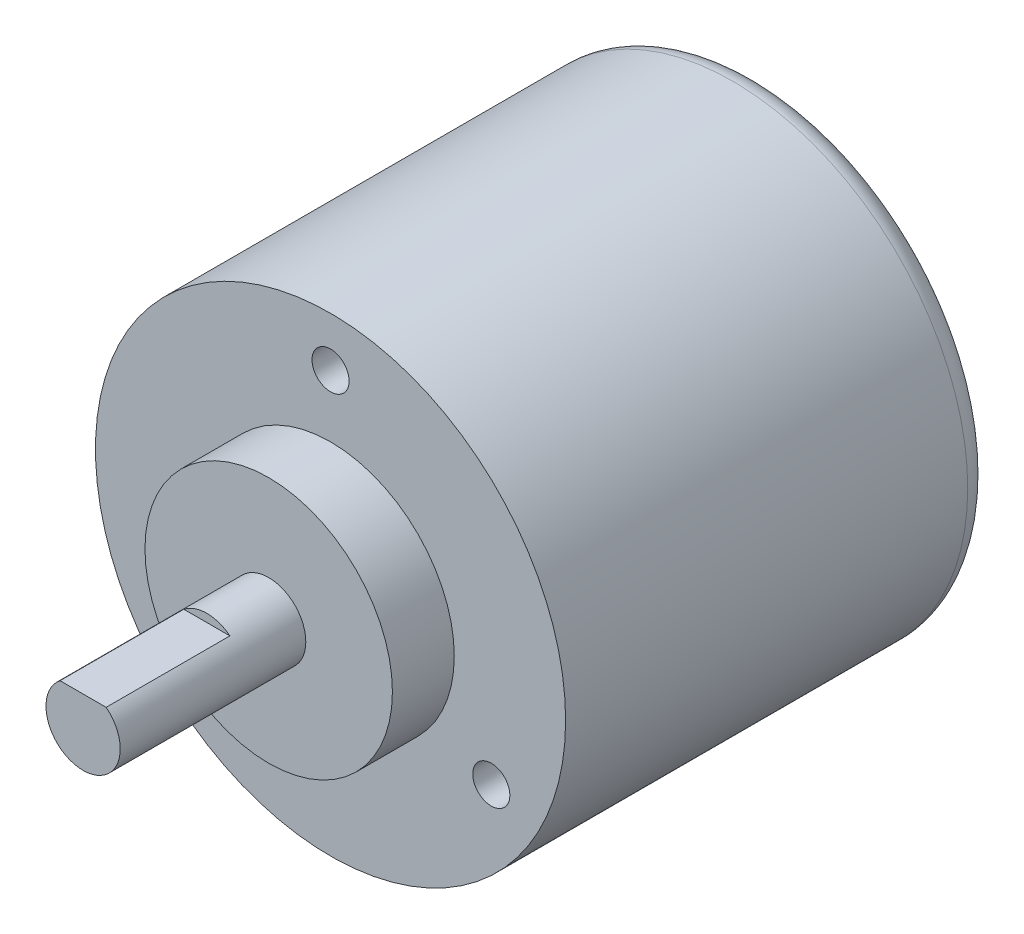
ISO-10303-21;
HEADER;
FILE_DESCRIPTION(('STEP AP214'),'2;1');
FILE_NAME('part.step','',(''),(''),'','','');
FILE_SCHEMA(('AUTOMOTIVE_DESIGN { 1 0 10303 214 1 1 1 1 }'));
ENDSEC;
DATA;
#1=APPLICATION_CONTEXT('core data for automotive mechanical design processes');
#2=APPLICATION_PROTOCOL_DEFINITION('international standard','automotive_design',2000,#1);
#3=PRODUCT_CONTEXT('',#1,'mechanical');
#4=PRODUCT('Part','Part','',(#3));
#5=PRODUCT_RELATED_PRODUCT_CATEGORY('part','',(#4));
#6=PRODUCT_DEFINITION_FORMATION('','',#4);
#7=PRODUCT_DEFINITION_CONTEXT('part definition',#1,'design');
#8=PRODUCT_DEFINITION('design','',#6,#7);
#9=PRODUCT_DEFINITION_SHAPE('','',#8);
#10=(LENGTH_UNIT() NAMED_UNIT(*) SI_UNIT(.MILLI.,.METRE.));
#11=(NAMED_UNIT(*) PLANE_ANGLE_UNIT() SI_UNIT($,.RADIAN.));
#12=(NAMED_UNIT(*) SI_UNIT($,.STERADIAN.) SOLID_ANGLE_UNIT());
#13=UNCERTAINTY_MEASURE_WITH_UNIT(LENGTH_MEASURE(1.E-05),#10,'distance_accuracy_value','');
#14=(GEOMETRIC_REPRESENTATION_CONTEXT(3) GLOBAL_UNCERTAINTY_ASSIGNED_CONTEXT((#13)) GLOBAL_UNIT_ASSIGNED_CONTEXT((#10,
#11,#12)) REPRESENTATION_CONTEXT('',''));
#15=CARTESIAN_POINT('',(0.,0.,0.));
#16=DIRECTION('',(0.,0.,1.));
#17=DIRECTION('',(1.,0.,0.));
#18=AXIS2_PLACEMENT_3D('',#15,#16,#17);
#19=CARTESIAN_POINT('',(0.,0.,34.5));
#20=DIRECTION('',(0.,0.,-1.));
#21=DIRECTION('',(-1.,0.,0.));
#22=AXIS2_PLACEMENT_3D('',#19,#20,#21);
#23=CYLINDRICAL_SURFACE('',#22,19.);
#24=CARTESIAN_POINT('',(0.,0.,2.));
#25=DIRECTION('',(0.,0.,1.));
#26=DIRECTION('',(1.,0.,0.));
#27=AXIS2_PLACEMENT_3D('',#24,#25,#26);
#28=CIRCLE('',#27,19.);
#29=CARTESIAN_POINT('',(19.,0.,2.));
#30=VERTEX_POINT('',#29);
#31=EDGE_CURVE('E43',#30,#30,#28,.T.);
#32=ORIENTED_EDGE('',*,*,#31,.T.);
#33=EDGE_LOOP('',(#32));
#34=FACE_BOUND('',#33,.T.);
#35=CARTESIAN_POINT('',(0.,0.,34.5));
#36=DIRECTION('',(0.,0.,1.));
#37=DIRECTION('',(1.,0.,0.));
#38=AXIS2_PLACEMENT_3D('',#35,#36,#37);
#39=CIRCLE('',#38,19.);
#40=CARTESIAN_POINT('',(19.,0.,34.5));
#41=VERTEX_POINT('',#40);
#42=EDGE_CURVE('E88',#41,#41,#39,.T.);
#43=ORIENTED_EDGE('',*,*,#42,.F.);
#44=EDGE_LOOP('',(#43));
#45=FACE_BOUND('',#44,.T.);
#46=ADVANCED_FACE('F35',(#34,#45),#23,.T.);
#47=CARTESIAN_POINT('',(0.,0.,34.5));
#48=DIRECTION('',(0.,0.,1.));
#49=DIRECTION('',(1.,0.,0.));
#50=AXIS2_PLACEMENT_3D('',#47,#48,#49);
#51=PLANE('',#50);
#52=CARTESIAN_POINT('',(0.,15.,34.5));
#53=DIRECTION('',(0.,0.,1.));
#54=DIRECTION('',(1.,0.,0.));
#55=AXIS2_PLACEMENT_3D('',#52,#53,#54);
#56=CIRCLE('',#55,1.5);
#57=CARTESIAN_POINT('',(1.5,15.,34.5));
#58=VERTEX_POINT('',#57);
#59=EDGE_CURVE('E160',#58,#58,#56,.T.);
#60=ORIENTED_EDGE('',*,*,#59,.F.);
#61=EDGE_LOOP('',(#60));
#62=FACE_BOUND('',#61,.T.);
#63=CARTESIAN_POINT('',(12.9903810567666,-7.50000000000001,34.5));
#64=DIRECTION('',(0.,0.,1.));
#65=DIRECTION('',(1.,0.,0.));
#66=AXIS2_PLACEMENT_3D('',#63,#64,#65);
#67=CIRCLE('',#66,1.5);
#68=CARTESIAN_POINT('',(14.4903810567666,-7.50000000000001,34.5));
#69=VERTEX_POINT('',#68);
#70=EDGE_CURVE('E168',#69,#69,#67,.T.);
#71=ORIENTED_EDGE('',*,*,#70,.F.);
#72=EDGE_LOOP('',(#71));
#73=FACE_BOUND('',#72,.T.);
#74=CARTESIAN_POINT('',(-12.9903810567666,-7.50000000000001,34.5));
#75=DIRECTION('',(0.,0.,1.));
#76=DIRECTION('',(1.,0.,0.));
#77=AXIS2_PLACEMENT_3D('',#74,#75,#76);
#78=CIRCLE('',#77,1.5);
#79=CARTESIAN_POINT('',(-11.4903810567666,-7.50000000000001,34.5));
#80=VERTEX_POINT('',#79);
#81=EDGE_CURVE('E174',#80,#80,#78,.T.);
#82=ORIENTED_EDGE('',*,*,#81,.F.);
#83=EDGE_LOOP('',(#82));
#84=FACE_BOUND('',#83,.T.);
#85=CARTESIAN_POINT('',(0.,0.,34.5));
#86=DIRECTION('',(0.,0.,1.));
#87=DIRECTION('',(1.,0.,0.));
#88=AXIS2_PLACEMENT_3D('',#85,#86,#87);
#89=CIRCLE('',#88,10.);
#90=CARTESIAN_POINT('',(10.,0.,34.5));
#91=VERTEX_POINT('',#90);
#92=EDGE_CURVE('E85',#91,#91,#89,.T.);
#93=ORIENTED_EDGE('',*,*,#92,.F.);
#94=EDGE_LOOP('',(#93));
#95=FACE_BOUND('',#94,.T.);
#96=ORIENTED_EDGE('',*,*,#42,.T.);
#97=EDGE_LOOP('',(#96));
#98=FACE_BOUND('',#97,.T.);
#99=ADVANCED_FACE('F111',(#62,#73,#84,#95,#98),#51,.T.);
#100=CARTESIAN_POINT('',(0.,0.,0.));
#101=DIRECTION('',(0.,0.,1.));
#102=DIRECTION('',(1.,0.,0.));
#103=AXIS2_PLACEMENT_3D('',#100,#101,#102);
#104=PLANE('',#103);
#105=CARTESIAN_POINT('',(0.,0.,0.));
#106=DIRECTION('',(0.,0.,1.));
#107=DIRECTION('',(1.,0.,0.));
#108=AXIS2_PLACEMENT_3D('',#105,#106,#107);
#109=CIRCLE('',#108,17.);
#110=CARTESIAN_POINT('',(17.,0.,0.));
#111=VERTEX_POINT('',#110);
#112=EDGE_CURVE('E11',#111,#111,#109,.F.);
#113=ORIENTED_EDGE('',*,*,#112,.T.);
#114=EDGE_LOOP('',(#113));
#115=FACE_BOUND('',#114,.T.);
#116=ADVANCED_FACE('F116',(#115),#104,.F.);
#117=CARTESIAN_POINT('',(0.,0.,39.5));
#118=DIRECTION('',(0.,0.,-1.));
#119=DIRECTION('',(-1.,0.,0.));
#120=AXIS2_PLACEMENT_3D('',#117,#118,#119);
#121=CYLINDRICAL_SURFACE('',#120,10.);
#122=CARTESIAN_POINT('',(0.,0.,39.5));
#123=DIRECTION('',(0.,0.,1.));
#124=DIRECTION('',(1.,0.,0.));
#125=AXIS2_PLACEMENT_3D('',#122,#123,#124);
#126=CIRCLE('',#125,10.);
#127=CARTESIAN_POINT('',(10.,0.,39.5));
#128=VERTEX_POINT('',#127);
#129=EDGE_CURVE('E78',#128,#128,#126,.T.);
#130=ORIENTED_EDGE('',*,*,#129,.F.);
#131=EDGE_LOOP('',(#130));
#132=FACE_BOUND('',#131,.T.);
#133=ORIENTED_EDGE('',*,*,#92,.T.);
#134=EDGE_LOOP('',(#133));
#135=FACE_BOUND('',#134,.T.);
#136=ADVANCED_FACE('F120',(#132,#135),#121,.T.);
#137=CARTESIAN_POINT('',(0.,0.,39.5));
#138=DIRECTION('',(0.,0.,1.));
#139=DIRECTION('',(1.,0.,0.));
#140=AXIS2_PLACEMENT_3D('',#137,#138,#139);
#141=PLANE('',#140);
#142=CARTESIAN_POINT('',(0.,0.,39.5));
#143=DIRECTION('',(0.,0.,1.));
#144=DIRECTION('',(1.,0.,0.));
#145=AXIS2_PLACEMENT_3D('',#142,#143,#144);
#146=CIRCLE('',#145,3.);
#147=CARTESIAN_POINT('',(3.,0.,39.5));
#148=VERTEX_POINT('',#147);
#149=EDGE_CURVE('E82',#148,#148,#146,.T.);
#150=ORIENTED_EDGE('',*,*,#149,.F.);
#151=EDGE_LOOP('',(#150));
#152=FACE_BOUND('',#151,.T.);
#153=ORIENTED_EDGE('',*,*,#129,.T.);
#154=EDGE_LOOP('',(#153));
#155=FACE_BOUND('',#154,.T.);
#156=ADVANCED_FACE('F125',(#152,#155),#141,.T.);
#157=CARTESIAN_POINT('',(0.,0.,54.5));
#158=DIRECTION('',(0.,0.,-1.));
#159=DIRECTION('',(-1.,0.,0.));
#160=AXIS2_PLACEMENT_3D('',#157,#158,#159);
#161=CYLINDRICAL_SURFACE('',#160,3.);
#162=CARTESIAN_POINT('',(0.,0.,54.5));
#163=DIRECTION('',(0.,0.,1.));
#164=DIRECTION('',(1.,0.,0.));
#165=AXIS2_PLACEMENT_3D('',#162,#163,#164);
#166=CIRCLE('',#165,3.);
#167=CARTESIAN_POINT('',(-1.86480561989715,2.35,54.5));
#168=VERTEX_POINT('',#167);
#169=CARTESIAN_POINT('',(1.86480561989715,2.35,54.5));
#170=VERTEX_POINT('',#169);
#171=EDGE_CURVE('E76',#168,#170,#166,.T.);
#172=ORIENTED_EDGE('',*,*,#171,.F.);
#173=DIRECTION('',(0.,0.,-1.));
#174=VECTOR('',#173,1.);
#175=CARTESIAN_POINT('',(-1.86480561989715,2.35,54.5));
#176=LINE('',#175,#174);
#177=CARTESIAN_POINT('',(-1.86480561989715,2.35,44.5));
#178=VERTEX_POINT('',#177);
#179=EDGE_CURVE('E50',#168,#178,#176,.T.);
#180=ORIENTED_EDGE('',*,*,#179,.T.);
#181=CARTESIAN_POINT('',(0.,0.,44.5));
#182=DIRECTION('',(0.,0.,-1.));
#183=DIRECTION('',(-1.,0.,0.));
#184=AXIS2_PLACEMENT_3D('',#181,#182,#183);
#185=CIRCLE('',#184,3.);
#186=CARTESIAN_POINT('',(1.86480561989715,2.35,44.5));
#187=VERTEX_POINT('',#186);
#188=EDGE_CURVE('E63',#178,#187,#185,.T.);
#189=ORIENTED_EDGE('',*,*,#188,.T.);
#190=DIRECTION('',(0.,0.,-1.));
#191=VECTOR('',#190,1.);
#192=CARTESIAN_POINT('',(1.86480561989715,2.35,54.5));
#193=LINE('',#192,#191);
#194=EDGE_CURVE('E69',#187,#170,#193,.F.);
#195=ORIENTED_EDGE('',*,*,#194,.T.);
#196=EDGE_LOOP('',(#172,#180,#189,#195));
#197=FACE_BOUND('',#196,.T.);
#198=ORIENTED_EDGE('',*,*,#149,.T.);
#199=EDGE_LOOP('',(#198));
#200=FACE_BOUND('',#199,.T.);
#201=ADVANCED_FACE('F73',(#197,#200),#161,.T.);
#202=CARTESIAN_POINT('',(0.,0.,54.5));
#203=DIRECTION('',(0.,0.,1.));
#204=DIRECTION('',(1.,0.,0.));
#205=AXIS2_PLACEMENT_3D('',#202,#203,#204);
#206=PLANE('',#205);
#207=DIRECTION('',(1.,0.,0.));
#208=VECTOR('',#207,1.);
#209=CARTESIAN_POINT('',(0.,2.35,54.5));
#210=LINE('',#209,#208);
#211=EDGE_CURVE('E54',#168,#170,#210,.T.);
#212=ORIENTED_EDGE('',*,*,#211,.F.);
#213=ORIENTED_EDGE('',*,*,#171,.T.);
#214=EDGE_LOOP('',(#212,#213));
#215=FACE_BOUND('',#214,.T.);
#216=ADVANCED_FACE('F132',(#215),#206,.T.);
#217=CARTESIAN_POINT('',(-19.,2.35,44.5));
#218=DIRECTION('',(0.,0.,-1.));
#219=DIRECTION('',(-1.,0.,0.));
#220=AXIS2_PLACEMENT_3D('',#217,#218,#219);
#221=PLANE('',#220);
#222=DIRECTION('',(1.,0.,0.));
#223=VECTOR('',#222,1.);
#224=CARTESIAN_POINT('',(-19.,2.35,44.5));
#225=LINE('',#224,#223);
#226=EDGE_CURVE('E65',#178,#187,#225,.T.);
#227=ORIENTED_EDGE('',*,*,#226,.T.);
#228=ORIENTED_EDGE('',*,*,#188,.F.);
#229=EDGE_LOOP('',(#227,#228));
#230=FACE_BOUND('',#229,.T.);
#231=ADVANCED_FACE('F64',(#230),#221,.F.);
#232=CARTESIAN_POINT('',(-19.,2.35,54.5));
#233=DIRECTION('',(0.,-1.,0.));
#234=DIRECTION('',(0.,0.,-1.));
#235=AXIS2_PLACEMENT_3D('',#232,#233,#234);
#236=PLANE('',#235);
#237=ORIENTED_EDGE('',*,*,#211,.T.);
#238=ORIENTED_EDGE('',*,*,#194,.F.);
#239=ORIENTED_EDGE('',*,*,#226,.F.);
#240=ORIENTED_EDGE('',*,*,#179,.F.);
#241=EDGE_LOOP('',(#237,#238,#239,#240));
#242=FACE_BOUND('',#241,.T.);
#243=ADVANCED_FACE('F68',(#242),#236,.F.);
#244=CARTESIAN_POINT('',(0.,0.,2.));
#245=DIRECTION('',(0.,0.,1.));
#246=DIRECTION('',(1.,0.,0.));
#247=AXIS2_PLACEMENT_3D('',#244,#245,#246);
#248=TOROIDAL_SURFACE('',#247,17.,2.);
#249=ORIENTED_EDGE('',*,*,#112,.F.);
#250=EDGE_LOOP('',(#249));
#251=FACE_BOUND('',#250,.T.);
#252=ORIENTED_EDGE('',*,*,#31,.F.);
#253=EDGE_LOOP('',(#252));
#254=FACE_BOUND('',#253,.T.);
#255=ADVANCED_FACE('F37',(#251,#254),#248,.T.);
#256=CARTESIAN_POINT('',(-12.9903810567666,-7.50000000000001,31.5));
#257=DIRECTION('',(0.,0.,1.));
#258=DIRECTION('',(1.,0.,0.));
#259=AXIS2_PLACEMENT_3D('',#256,#257,#258);
#260=CYLINDRICAL_SURFACE('',#259,1.5);
#261=CARTESIAN_POINT('',(-12.9903810567666,-7.50000000000001,31.5));
#262=DIRECTION('',(0.,0.,1.));
#263=DIRECTION('',(1.,0.,0.));
#264=AXIS2_PLACEMENT_3D('',#261,#262,#263);
#265=CIRCLE('',#264,1.5);
#266=CARTESIAN_POINT('',(-11.4903810567666,-7.50000000000001,31.5));
#267=VERTEX_POINT('',#266);
#268=EDGE_CURVE('E171',#267,#267,#265,.T.);
#269=ORIENTED_EDGE('',*,*,#268,.F.);
#270=EDGE_LOOP('',(#269));
#271=FACE_BOUND('',#270,.T.);
#272=ORIENTED_EDGE('',*,*,#81,.T.);
#273=EDGE_LOOP('',(#272));
#274=FACE_BOUND('',#273,.T.);
#275=ADVANCED_FACE('F99',(#271,#274),#260,.F.);
#276=CARTESIAN_POINT('',(-12.9903810567666,-7.50000000000001,31.5));
#277=DIRECTION('',(0.,0.,1.));
#278=DIRECTION('',(1.,0.,0.));
#279=AXIS2_PLACEMENT_3D('',#276,#277,#278);
#280=PLANE('',#279);
#281=ORIENTED_EDGE('',*,*,#268,.T.);
#282=EDGE_LOOP('',(#281));
#283=FACE_BOUND('',#282,.T.);
#284=ADVANCED_FACE('F105',(#283),#280,.T.);
#285=CARTESIAN_POINT('',(12.9903810567666,-7.50000000000001,31.5));
#286=DIRECTION('',(0.,0.,1.));
#287=DIRECTION('',(1.,0.,0.));
#288=AXIS2_PLACEMENT_3D('',#285,#286,#287);
#289=CYLINDRICAL_SURFACE('',#288,1.5);
#290=CARTESIAN_POINT('',(12.9903810567666,-7.50000000000001,31.5));
#291=DIRECTION('',(0.,0.,1.));
#292=DIRECTION('',(1.,0.,0.));
#293=AXIS2_PLACEMENT_3D('',#290,#291,#292);
#294=CIRCLE('',#293,1.5);
#295=CARTESIAN_POINT('',(14.4903810567666,-7.50000000000001,31.5));
#296=VERTEX_POINT('',#295);
#297=EDGE_CURVE('E163',#296,#296,#294,.T.);
#298=ORIENTED_EDGE('',*,*,#297,.F.);
#299=EDGE_LOOP('',(#298));
#300=FACE_BOUND('',#299,.T.);
#301=ORIENTED_EDGE('',*,*,#70,.T.);
#302=EDGE_LOOP('',(#301));
#303=FACE_BOUND('',#302,.T.);
#304=ADVANCED_FACE('F140',(#300,#303),#289,.F.);
#305=CARTESIAN_POINT('',(12.9903810567666,-7.50000000000001,31.5));
#306=DIRECTION('',(0.,0.,1.));
#307=DIRECTION('',(1.,0.,0.));
#308=AXIS2_PLACEMENT_3D('',#305,#306,#307);
#309=PLANE('',#308);
#310=ORIENTED_EDGE('',*,*,#297,.T.);
#311=EDGE_LOOP('',(#310));
#312=FACE_BOUND('',#311,.T.);
#313=ADVANCED_FACE('F144',(#312),#309,.T.);
#314=CARTESIAN_POINT('',(0.,15.,31.5));
#315=DIRECTION('',(0.,0.,1.));
#316=DIRECTION('',(1.,0.,0.));
#317=AXIS2_PLACEMENT_3D('',#314,#315,#316);
#318=CYLINDRICAL_SURFACE('',#317,1.5);
#319=CARTESIAN_POINT('',(0.,15.,31.5));
#320=DIRECTION('',(0.,0.,1.));
#321=DIRECTION('',(1.,0.,0.));
#322=AXIS2_PLACEMENT_3D('',#319,#320,#321);
#323=CIRCLE('',#322,1.5);
#324=CARTESIAN_POINT('',(1.5,15.,31.5));
#325=VERTEX_POINT('',#324);
#326=EDGE_CURVE('E70',#325,#325,#323,.T.);
#327=ORIENTED_EDGE('',*,*,#326,.F.);
#328=EDGE_LOOP('',(#327));
#329=FACE_BOUND('',#328,.T.);
#330=ORIENTED_EDGE('',*,*,#59,.T.);
#331=EDGE_LOOP('',(#330));
#332=FACE_BOUND('',#331,.T.);
#333=ADVANCED_FACE('F148',(#329,#332),#318,.F.);
#334=CARTESIAN_POINT('',(0.,15.,31.5));
#335=DIRECTION('',(0.,0.,1.));
#336=DIRECTION('',(1.,0.,0.));
#337=AXIS2_PLACEMENT_3D('',#334,#335,#336);
#338=PLANE('',#337);
#339=ORIENTED_EDGE('',*,*,#326,.T.);
#340=EDGE_LOOP('',(#339));
#341=FACE_BOUND('',#340,.T.);
#342=ADVANCED_FACE('F152',(#341),#338,.T.);
#343=CLOSED_SHELL('',(#46,#99,#116,#136,#156,#201,#216,#231,#243,#255,#275,#284,#304,#313,#333,#342));
#344=MANIFOLD_SOLID_BREP('B2',#343);
#345=ADVANCED_BREP_SHAPE_REPRESENTATION('',(#18,#344),#14);
#346=SHAPE_DEFINITION_REPRESENTATION(#9,#345);
ENDSEC;
END-ISO-10303-21;
